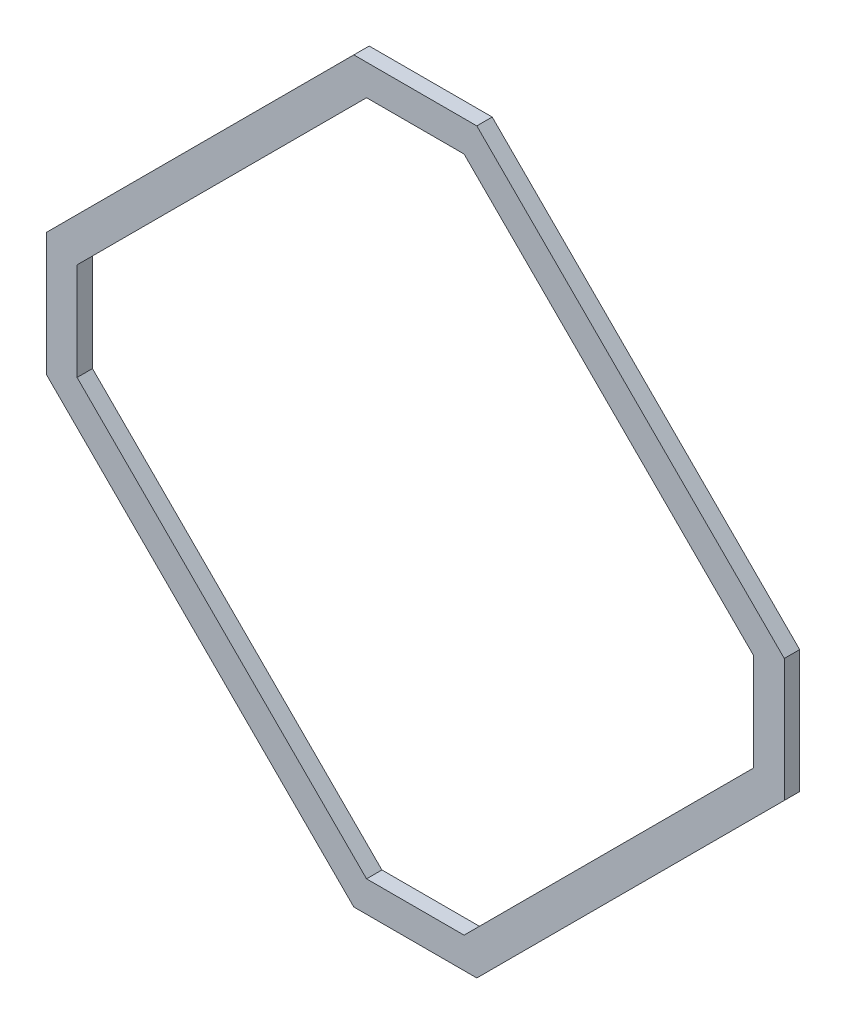
ISO-10303-21;
HEADER;
FILE_DESCRIPTION(('STEP AP214'),'2;1');
FILE_NAME('part.step','',(''),(''),'','','');
FILE_SCHEMA(('AUTOMOTIVE_DESIGN { 1 0 10303 214 1 1 1 1 }'));
ENDSEC;
DATA;
#1=APPLICATION_CONTEXT('core data for automotive mechanical design processes');
#2=APPLICATION_PROTOCOL_DEFINITION('international standard','automotive_design',2000,#1);
#3=PRODUCT_CONTEXT('',#1,'mechanical');
#4=PRODUCT('Part','Part','',(#3));
#5=PRODUCT_RELATED_PRODUCT_CATEGORY('part','',(#4));
#6=PRODUCT_DEFINITION_FORMATION('','',#4);
#7=PRODUCT_DEFINITION_CONTEXT('part definition',#1,'design');
#8=PRODUCT_DEFINITION('design','',#6,#7);
#9=PRODUCT_DEFINITION_SHAPE('','',#8);
#10=(LENGTH_UNIT() NAMED_UNIT(*) SI_UNIT(.MILLI.,.METRE.));
#11=(NAMED_UNIT(*) PLANE_ANGLE_UNIT() SI_UNIT($,.RADIAN.));
#12=(NAMED_UNIT(*) SI_UNIT($,.STERADIAN.) SOLID_ANGLE_UNIT());
#13=UNCERTAINTY_MEASURE_WITH_UNIT(LENGTH_MEASURE(1.E-05),#10,'distance_accuracy_value','');
#14=(GEOMETRIC_REPRESENTATION_CONTEXT(3) GLOBAL_UNCERTAINTY_ASSIGNED_CONTEXT((#13)) GLOBAL_UNIT_ASSIGNED_CONTEXT((#10,
#11,#12)) REPRESENTATION_CONTEXT('',''));
#15=CARTESIAN_POINT('',(0.,0.,0.));
#16=DIRECTION('',(0.,0.,1.));
#17=DIRECTION('',(1.,0.,0.));
#18=AXIS2_PLACEMENT_3D('',#15,#16,#17);
#19=CARTESIAN_POINT('',(0.,0.,3.175));
#20=DIRECTION('',(0.,0.,1.));
#21=DIRECTION('',(1.,0.,0.));
#22=AXIS2_PLACEMENT_3D('',#19,#20,#21);
#23=PLANE('',#22);
#24=DIRECTION('',(0.,1.,0.));
#25=VECTOR('',#24,1.);
#26=CARTESIAN_POINT('',(63.5000000000004,-103.9114,3.175));
#27=LINE('',#26,#25);
#28=CARTESIAN_POINT('',(63.5000000000004,-103.9114,3.175));
#29=VERTEX_POINT('',#28);
#30=CARTESIAN_POINT('',(63.5000000000005,-78.5113999999998,3.175));
#31=VERTEX_POINT('',#30);
#32=EDGE_CURVE('E259',#29,#31,#27,.T.);
#33=ORIENTED_EDGE('',*,*,#32,.T.);
#34=DIRECTION('',(-0.707106781186549,0.707106781186546,0.));
#35=VECTOR('',#34,1.);
#36=CARTESIAN_POINT('',(63.5000000000005,-78.5113999999998,3.175));
#37=LINE('',#36,#35);
#38=CARTESIAN_POINT('',(3.40005801291454E-13,-15.0113999999998,3.175));
#39=VERTEX_POINT('',#38);
#40=EDGE_CURVE('E262',#31,#39,#37,.T.);
#41=ORIENTED_EDGE('',*,*,#40,.T.);
#42=DIRECTION('',(-1.,0.,0.));
#43=VECTOR('',#42,1.);
#44=CARTESIAN_POINT('',(3.40005801291454E-13,-15.0113999999998,3.175));
#45=LINE('',#44,#43);
#46=CARTESIAN_POINT('',(-25.3999999999997,-15.0113999999997,3.175));
#47=VERTEX_POINT('',#46);
#48=EDGE_CURVE('E265',#39,#47,#45,.T.);
#49=ORIENTED_EDGE('',*,*,#48,.T.);
#50=DIRECTION('',(-0.707106781186546,-0.707106781186549,0.));
#51=VECTOR('',#50,1.);
#52=CARTESIAN_POINT('',(-25.3999999999997,-15.0113999999997,3.175));
#53=LINE('',#52,#51);
#54=CARTESIAN_POINT('',(-88.8999999999996,-78.5113999999999,3.175));
#55=VERTEX_POINT('',#54);
#56=EDGE_CURVE('E267',#47,#55,#53,.T.);
#57=ORIENTED_EDGE('',*,*,#56,.T.);
#58=DIRECTION('',(0.,-1.,0.));
#59=VECTOR('',#58,1.);
#60=CARTESIAN_POINT('',(-88.8999999999996,-78.5113999999999,3.175));
#61=LINE('',#60,#59);
#62=CARTESIAN_POINT('',(-88.8999999999997,-103.9114,3.175));
#63=VERTEX_POINT('',#62);
#64=EDGE_CURVE('E269',#55,#63,#61,.T.);
#65=ORIENTED_EDGE('',*,*,#64,.T.);
#66=DIRECTION('',(0.707106781186549,-0.707106781186546,0.));
#67=VECTOR('',#66,1.);
#68=CARTESIAN_POINT('',(-88.8999999999997,-103.9114,3.175));
#69=LINE('',#68,#67);
#70=CARTESIAN_POINT('',(-25.3999999999995,-167.4114,3.175));
#71=VERTEX_POINT('',#70);
#72=EDGE_CURVE('E271',#63,#71,#69,.T.);
#73=ORIENTED_EDGE('',*,*,#72,.T.);
#74=DIRECTION('',(1.,0.,0.));
#75=VECTOR('',#74,1.);
#76=CARTESIAN_POINT('',(-25.3999999999995,-167.4114,3.175));
#77=LINE('',#76,#75);
#78=CARTESIAN_POINT('',(4.9960036108132E-13,-167.4114,3.175));
#79=VERTEX_POINT('',#78);
#80=EDGE_CURVE('E273',#71,#79,#77,.T.);
#81=ORIENTED_EDGE('',*,*,#80,.T.);
#82=DIRECTION('',(0.707106781186546,0.707106781186549,0.));
#83=VECTOR('',#82,1.);
#84=CARTESIAN_POINT('',(4.9960036108132E-13,-167.4114,3.175));
#85=LINE('',#84,#83);
#86=EDGE_CURVE('E275',#79,#29,#85,.T.);
#87=ORIENTED_EDGE('',*,*,#86,.T.);
#88=EDGE_LOOP('',(#33,#41,#49,#57,#65,#73,#81,#87));
#89=FACE_BOUND('',#88,.T.);
#90=DIRECTION('',(-0.707106781186549,0.707106781186546,0.));
#91=VECTOR('',#90,1.);
#92=CARTESIAN_POINT('',(57.1500000000005,-81.1416561210689,3.175));
#93=LINE('',#92,#91);
#94=CARTESIAN_POINT('',(57.1500000000005,-81.1416561210689,3.175));
#95=VERTEX_POINT('',#94);
#96=CARTESIAN_POINT('',(-2.63025612106882,-21.3613999999998,3.175));
#97=VERTEX_POINT('',#96);
#98=EDGE_CURVE('E202',#95,#97,#93,.T.);
#99=ORIENTED_EDGE('',*,*,#98,.F.);
#100=DIRECTION('',(0.,1.,0.));
#101=VECTOR('',#100,1.);
#102=CARTESIAN_POINT('',(57.1500000000005,-101.28114387893,3.175));
#103=LINE('',#102,#101);
#104=CARTESIAN_POINT('',(57.1500000000005,-101.28114387893,3.175));
#105=VERTEX_POINT('',#104);
#106=EDGE_CURVE('E194',#105,#95,#103,.T.);
#107=ORIENTED_EDGE('',*,*,#106,.F.);
#108=DIRECTION('',(0.707106781186546,0.707106781186549,0.));
#109=VECTOR('',#108,1.);
#110=CARTESIAN_POINT('',(-2.63025612106868,-161.0614,3.175));
#111=LINE('',#110,#109);
#112=CARTESIAN_POINT('',(-2.63025612106867,-161.0614,3.175));
#113=VERTEX_POINT('',#112);
#114=EDGE_CURVE('E227',#113,#105,#111,.T.);
#115=ORIENTED_EDGE('',*,*,#114,.F.);
#116=DIRECTION('',(1.,0.,0.));
#117=VECTOR('',#116,1.);
#118=CARTESIAN_POINT('',(-22.7697438789303,-161.0614,3.175));
#119=LINE('',#118,#117);
#120=CARTESIAN_POINT('',(-22.7697438789303,-161.0614,3.175));
#121=VERTEX_POINT('',#120);
#122=EDGE_CURVE('E225',#121,#113,#119,.T.);
#123=ORIENTED_EDGE('',*,*,#122,.F.);
#124=DIRECTION('',(0.707106781186549,-0.707106781186546,0.));
#125=VECTOR('',#124,1.);
#126=CARTESIAN_POINT('',(-82.5499999999997,-101.281143878931,3.175));
#127=LINE('',#126,#125);
#128=CARTESIAN_POINT('',(-82.5499999999997,-101.281143878931,3.175));
#129=VERTEX_POINT('',#128);
#130=EDGE_CURVE('E223',#129,#121,#127,.T.);
#131=ORIENTED_EDGE('',*,*,#130,.F.);
#132=DIRECTION('',(0.,-1.,0.));
#133=VECTOR('',#132,1.);
#134=CARTESIAN_POINT('',(-82.5499999999997,-81.1416561210691,3.175));
#135=LINE('',#134,#133);
#136=CARTESIAN_POINT('',(-82.5499999999997,-81.1416561210691,3.175));
#137=VERTEX_POINT('',#136);
#138=EDGE_CURVE('E221',#137,#129,#135,.T.);
#139=ORIENTED_EDGE('',*,*,#138,.F.);
#140=DIRECTION('',(-0.707106781186546,-0.707106781186549,0.));
#141=VECTOR('',#140,1.);
#142=CARTESIAN_POINT('',(-22.7697438789306,-21.3613999999998,3.175));
#143=LINE('',#142,#141);
#144=CARTESIAN_POINT('',(-22.7697438789306,-21.3613999999998,3.175));
#145=VERTEX_POINT('',#144);
#146=EDGE_CURVE('E217',#145,#137,#143,.T.);
#147=ORIENTED_EDGE('',*,*,#146,.F.);
#148=DIRECTION('',(-1.,0.,0.));
#149=VECTOR('',#148,1.);
#150=CARTESIAN_POINT('',(-2.63025612106882,-21.3613999999998,3.175));
#151=LINE('',#150,#149);
#152=EDGE_CURVE('E215',#97,#145,#151,.T.);
#153=ORIENTED_EDGE('',*,*,#152,.F.);
#154=EDGE_LOOP('',(#99,#107,#115,#123,#131,#139,#147,#153));
#155=FACE_BOUND('',#154,.T.);
#156=ADVANCED_FACE('F81',(#89,#155),#23,.T.);
#157=CARTESIAN_POINT('',(0.,0.,0.));
#158=DIRECTION('',(0.,0.,1.));
#159=DIRECTION('',(1.,0.,0.));
#160=AXIS2_PLACEMENT_3D('',#157,#158,#159);
#161=PLANE('',#160);
#162=DIRECTION('',(0.,1.,0.));
#163=VECTOR('',#162,1.);
#164=CARTESIAN_POINT('',(63.5000000000004,-103.9114,0.));
#165=LINE('',#164,#163);
#166=CARTESIAN_POINT('',(63.5000000000004,-103.9114,0.));
#167=VERTEX_POINT('',#166);
#168=CARTESIAN_POINT('',(63.5000000000005,-78.5113999999998,0.));
#169=VERTEX_POINT('',#168);
#170=EDGE_CURVE('E210',#167,#169,#165,.T.);
#171=ORIENTED_EDGE('',*,*,#170,.F.);
#172=DIRECTION('',(0.707106781186546,0.707106781186549,0.));
#173=VECTOR('',#172,1.);
#174=CARTESIAN_POINT('',(4.9960036108132E-13,-167.4114,0.));
#175=LINE('',#174,#173);
#176=CARTESIAN_POINT('',(4.9960036108132E-13,-167.4114,0.));
#177=VERTEX_POINT('',#176);
#178=EDGE_CURVE('E263',#177,#167,#175,.T.);
#179=ORIENTED_EDGE('',*,*,#178,.F.);
#180=DIRECTION('',(1.,0.,0.));
#181=VECTOR('',#180,1.);
#182=CARTESIAN_POINT('',(-25.3999999999995,-167.4114,0.));
#183=LINE('',#182,#181);
#184=CARTESIAN_POINT('',(-25.3999999999995,-167.4114,0.));
#185=VERTEX_POINT('',#184);
#186=EDGE_CURVE('E290',#185,#177,#183,.T.);
#187=ORIENTED_EDGE('',*,*,#186,.F.);
#188=DIRECTION('',(0.707106781186549,-0.707106781186546,0.));
#189=VECTOR('',#188,1.);
#190=CARTESIAN_POINT('',(-88.8999999999997,-103.9114,0.));
#191=LINE('',#190,#189);
#192=CARTESIAN_POINT('',(-88.8999999999997,-103.9114,0.));
#193=VERTEX_POINT('',#192);
#194=EDGE_CURVE('E288',#193,#185,#191,.T.);
#195=ORIENTED_EDGE('',*,*,#194,.F.);
#196=DIRECTION('',(0.,-1.,0.));
#197=VECTOR('',#196,1.);
#198=CARTESIAN_POINT('',(-88.8999999999996,-78.5113999999999,0.));
#199=LINE('',#198,#197);
#200=CARTESIAN_POINT('',(-88.8999999999996,-78.5113999999999,0.));
#201=VERTEX_POINT('',#200);
#202=EDGE_CURVE('E286',#201,#193,#199,.T.);
#203=ORIENTED_EDGE('',*,*,#202,.F.);
#204=DIRECTION('',(-0.707106781186546,-0.707106781186549,0.));
#205=VECTOR('',#204,1.);
#206=CARTESIAN_POINT('',(-25.3999999999997,-15.0113999999997,0.));
#207=LINE('',#206,#205);
#208=CARTESIAN_POINT('',(-25.3999999999997,-15.0113999999997,0.));
#209=VERTEX_POINT('',#208);
#210=EDGE_CURVE('E284',#209,#201,#207,.T.);
#211=ORIENTED_EDGE('',*,*,#210,.F.);
#212=DIRECTION('',(-1.,0.,0.));
#213=VECTOR('',#212,1.);
#214=CARTESIAN_POINT('',(3.40005801291454E-13,-15.0113999999998,0.));
#215=LINE('',#214,#213);
#216=CARTESIAN_POINT('',(3.40005801291454E-13,-15.0113999999998,0.));
#217=VERTEX_POINT('',#216);
#218=EDGE_CURVE('E282',#217,#209,#215,.T.);
#219=ORIENTED_EDGE('',*,*,#218,.F.);
#220=DIRECTION('',(-0.707106781186549,0.707106781186546,0.));
#221=VECTOR('',#220,1.);
#222=CARTESIAN_POINT('',(63.5000000000005,-78.5113999999998,0.));
#223=LINE('',#222,#221);
#224=EDGE_CURVE('E280',#169,#217,#223,.T.);
#225=ORIENTED_EDGE('',*,*,#224,.F.);
#226=EDGE_LOOP('',(#171,#179,#187,#195,#203,#211,#219,#225));
#227=FACE_BOUND('',#226,.T.);
#228=DIRECTION('',(0.,1.,0.));
#229=VECTOR('',#228,1.);
#230=CARTESIAN_POINT('',(57.1500000000005,-101.28114387893,0.));
#231=LINE('',#230,#229);
#232=CARTESIAN_POINT('',(57.1500000000005,-101.28114387893,0.));
#233=VERTEX_POINT('',#232);
#234=CARTESIAN_POINT('',(57.1500000000005,-81.1416561210689,0.));
#235=VERTEX_POINT('',#234);
#236=EDGE_CURVE('E104',#233,#235,#231,.T.);
#237=ORIENTED_EDGE('',*,*,#236,.T.);
#238=DIRECTION('',(-0.707106781186549,0.707106781186546,0.));
#239=VECTOR('',#238,1.);
#240=CARTESIAN_POINT('',(57.1500000000005,-81.1416561210689,0.));
#241=LINE('',#240,#239);
#242=CARTESIAN_POINT('',(-2.63025612106882,-21.3613999999998,0.));
#243=VERTEX_POINT('',#242);
#244=EDGE_CURVE('E209',#235,#243,#241,.T.);
#245=ORIENTED_EDGE('',*,*,#244,.T.);
#246=DIRECTION('',(-1.,0.,0.));
#247=VECTOR('',#246,1.);
#248=CARTESIAN_POINT('',(-2.63025612106882,-21.3613999999998,0.));
#249=LINE('',#248,#247);
#250=CARTESIAN_POINT('',(-22.7697438789306,-21.3613999999998,0.));
#251=VERTEX_POINT('',#250);
#252=EDGE_CURVE('E231',#243,#251,#249,.T.);
#253=ORIENTED_EDGE('',*,*,#252,.T.);
#254=DIRECTION('',(-0.707106781186546,-0.707106781186549,0.));
#255=VECTOR('',#254,1.);
#256=CARTESIAN_POINT('',(-22.7697438789306,-21.3613999999998,0.));
#257=LINE('',#256,#255);
#258=CARTESIAN_POINT('',(-82.5499999999997,-81.1416561210691,0.));
#259=VERTEX_POINT('',#258);
#260=EDGE_CURVE('E234',#251,#259,#257,.T.);
#261=ORIENTED_EDGE('',*,*,#260,.T.);
#262=DIRECTION('',(0.,-1.,0.));
#263=VECTOR('',#262,1.);
#264=CARTESIAN_POINT('',(-82.5499999999997,-81.1416561210691,0.));
#265=LINE('',#264,#263);
#266=CARTESIAN_POINT('',(-82.5499999999997,-101.281143878931,0.));
#267=VERTEX_POINT('',#266);
#268=EDGE_CURVE('E237',#259,#267,#265,.T.);
#269=ORIENTED_EDGE('',*,*,#268,.T.);
#270=DIRECTION('',(0.707106781186549,-0.707106781186546,0.));
#271=VECTOR('',#270,1.);
#272=CARTESIAN_POINT('',(-82.5499999999997,-101.281143878931,0.));
#273=LINE('',#272,#271);
#274=CARTESIAN_POINT('',(-22.7697438789303,-161.0614,0.));
#275=VERTEX_POINT('',#274);
#276=EDGE_CURVE('E240',#267,#275,#273,.T.);
#277=ORIENTED_EDGE('',*,*,#276,.T.);
#278=DIRECTION('',(1.,0.,0.));
#279=VECTOR('',#278,1.);
#280=CARTESIAN_POINT('',(-22.7697438789303,-161.0614,0.));
#281=LINE('',#280,#279);
#282=CARTESIAN_POINT('',(-2.63025612106868,-161.0614,0.));
#283=VERTEX_POINT('',#282);
#284=EDGE_CURVE('E243',#275,#283,#281,.T.);
#285=ORIENTED_EDGE('',*,*,#284,.T.);
#286=DIRECTION('',(0.707106781186546,0.707106781186549,0.));
#287=VECTOR('',#286,1.);
#288=CARTESIAN_POINT('',(-2.63025612106868,-161.0614,0.));
#289=LINE('',#288,#287);
#290=EDGE_CURVE('E203',#283,#233,#289,.T.);
#291=ORIENTED_EDGE('',*,*,#290,.T.);
#292=EDGE_LOOP('',(#237,#245,#253,#261,#269,#277,#285,#291));
#293=FACE_BOUND('',#292,.T.);
#294=ADVANCED_FACE('F320',(#227,#293),#161,.F.);
#295=CARTESIAN_POINT('',(63.5000000000004,-103.9114,3.175));
#296=DIRECTION('',(-1.,0.,0.));
#297=DIRECTION('',(0.,-1.,0.));
#298=AXIS2_PLACEMENT_3D('',#295,#296,#297);
#299=PLANE('',#298);
#300=ORIENTED_EDGE('',*,*,#170,.T.);
#301=DIRECTION('',(0.,0.,-1.));
#302=VECTOR('',#301,1.);
#303=CARTESIAN_POINT('',(63.5000000000005,-78.5113999999998,3.175));
#304=LINE('',#303,#302);
#305=EDGE_CURVE('E12',#31,#169,#304,.T.);
#306=ORIENTED_EDGE('',*,*,#305,.F.);
#307=ORIENTED_EDGE('',*,*,#32,.F.);
#308=DIRECTION('',(0.,0.,-1.));
#309=VECTOR('',#308,1.);
#310=CARTESIAN_POINT('',(63.5000000000004,-103.9114,3.175));
#311=LINE('',#310,#309);
#312=EDGE_CURVE('E277',#29,#167,#311,.T.);
#313=ORIENTED_EDGE('',*,*,#312,.T.);
#314=EDGE_LOOP('',(#300,#306,#307,#313));
#315=FACE_BOUND('',#314,.T.);
#316=ADVANCED_FACE('F83',(#315),#299,.F.);
#317=CARTESIAN_POINT('',(63.5000000000005,-78.5113999999998,3.175));
#318=DIRECTION('',(-0.707106781186546,-0.707106781186548,0.));
#319=DIRECTION('',(0.707106781186549,-0.707106781186547,0.));
#320=AXIS2_PLACEMENT_3D('',#317,#318,#319);
#321=PLANE('',#320);
#322=ORIENTED_EDGE('',*,*,#224,.T.);
#323=DIRECTION('',(0.,0.,-1.));
#324=VECTOR('',#323,1.);
#325=CARTESIAN_POINT('',(3.40005801291454E-13,-15.0113999999998,3.175));
#326=LINE('',#325,#324);
#327=EDGE_CURVE('E89',#39,#217,#326,.T.);
#328=ORIENTED_EDGE('',*,*,#327,.F.);
#329=ORIENTED_EDGE('',*,*,#40,.F.);
#330=ORIENTED_EDGE('',*,*,#305,.T.);
#331=EDGE_LOOP('',(#322,#328,#329,#330));
#332=FACE_BOUND('',#331,.T.);
#333=ADVANCED_FACE('F337',(#332),#321,.F.);
#334=CARTESIAN_POINT('',(3.40005801291454E-13,-15.0113999999998,3.175));
#335=DIRECTION('',(0.,-1.,0.));
#336=DIRECTION('',(1.,0.,0.));
#337=AXIS2_PLACEMENT_3D('',#334,#335,#336);
#338=PLANE('',#337);
#339=ORIENTED_EDGE('',*,*,#218,.T.);
#340=DIRECTION('',(0.,0.,-1.));
#341=VECTOR('',#340,1.);
#342=CARTESIAN_POINT('',(-25.3999999999997,-15.0113999999997,3.175));
#343=LINE('',#342,#341);
#344=EDGE_CURVE('E307',#47,#209,#343,.T.);
#345=ORIENTED_EDGE('',*,*,#344,.F.);
#346=ORIENTED_EDGE('',*,*,#48,.F.);
#347=ORIENTED_EDGE('',*,*,#327,.T.);
#348=EDGE_LOOP('',(#339,#345,#346,#347));
#349=FACE_BOUND('',#348,.T.);
#350=ADVANCED_FACE('F314',(#349),#338,.F.);
#351=CARTESIAN_POINT('',(-25.3999999999997,-15.0113999999997,3.175));
#352=DIRECTION('',(0.707106781186549,-0.707106781186546,0.));
#353=DIRECTION('',(0.707106781186546,0.707106781186549,0.));
#354=AXIS2_PLACEMENT_3D('',#351,#352,#353);
#355=PLANE('',#354);
#356=ORIENTED_EDGE('',*,*,#210,.T.);
#357=DIRECTION('',(0.,0.,-1.));
#358=VECTOR('',#357,1.);
#359=CARTESIAN_POINT('',(-88.8999999999996,-78.5113999999999,3.175));
#360=LINE('',#359,#358);
#361=EDGE_CURVE('E304',#55,#201,#360,.T.);
#362=ORIENTED_EDGE('',*,*,#361,.F.);
#363=ORIENTED_EDGE('',*,*,#56,.F.);
#364=ORIENTED_EDGE('',*,*,#344,.T.);
#365=EDGE_LOOP('',(#356,#362,#363,#364));
#366=FACE_BOUND('',#365,.T.);
#367=ADVANCED_FACE('F326',(#366),#355,.F.);
#368=CARTESIAN_POINT('',(-88.8999999999996,-78.5113999999999,3.175));
#369=DIRECTION('',(1.,0.,0.));
#370=DIRECTION('',(0.,1.,0.));
#371=AXIS2_PLACEMENT_3D('',#368,#369,#370);
#372=PLANE('',#371);
#373=ORIENTED_EDGE('',*,*,#202,.T.);
#374=DIRECTION('',(0.,0.,-1.));
#375=VECTOR('',#374,1.);
#376=CARTESIAN_POINT('',(-88.8999999999997,-103.9114,3.175));
#377=LINE('',#376,#375);
#378=EDGE_CURVE('E301',#63,#193,#377,.T.);
#379=ORIENTED_EDGE('',*,*,#378,.F.);
#380=ORIENTED_EDGE('',*,*,#64,.F.);
#381=ORIENTED_EDGE('',*,*,#361,.T.);
#382=EDGE_LOOP('',(#373,#379,#380,#381));
#383=FACE_BOUND('',#382,.T.);
#384=ADVANCED_FACE('F330',(#383),#372,.F.);
#385=CARTESIAN_POINT('',(-88.8999999999997,-103.9114,3.175));
#386=DIRECTION('',(0.707106781186546,0.707106781186549,0.));
#387=DIRECTION('',(-0.707106781186549,0.707106781186546,0.));
#388=AXIS2_PLACEMENT_3D('',#385,#386,#387);
#389=PLANE('',#388);
#390=ORIENTED_EDGE('',*,*,#194,.T.);
#391=DIRECTION('',(0.,0.,-1.));
#392=VECTOR('',#391,1.);
#393=CARTESIAN_POINT('',(-25.3999999999995,-167.4114,3.175));
#394=LINE('',#393,#392);
#395=EDGE_CURVE('E298',#71,#185,#394,.T.);
#396=ORIENTED_EDGE('',*,*,#395,.F.);
#397=ORIENTED_EDGE('',*,*,#72,.F.);
#398=ORIENTED_EDGE('',*,*,#378,.T.);
#399=EDGE_LOOP('',(#390,#396,#397,#398));
#400=FACE_BOUND('',#399,.T.);
#401=ADVANCED_FACE('F350',(#400),#389,.F.);
#402=CARTESIAN_POINT('',(-25.3999999999995,-167.4114,3.175));
#403=DIRECTION('',(0.,1.,0.));
#404=DIRECTION('',(-1.,0.,0.));
#405=AXIS2_PLACEMENT_3D('',#402,#403,#404);
#406=PLANE('',#405);
#407=ORIENTED_EDGE('',*,*,#186,.T.);
#408=DIRECTION('',(0.,0.,-1.));
#409=VECTOR('',#408,1.);
#410=CARTESIAN_POINT('',(4.9960036108132E-13,-167.4114,3.175));
#411=LINE('',#410,#409);
#412=EDGE_CURVE('E295',#79,#177,#411,.T.);
#413=ORIENTED_EDGE('',*,*,#412,.F.);
#414=ORIENTED_EDGE('',*,*,#80,.F.);
#415=ORIENTED_EDGE('',*,*,#395,.T.);
#416=EDGE_LOOP('',(#407,#413,#414,#415));
#417=FACE_BOUND('',#416,.T.);
#418=ADVANCED_FACE('F348',(#417),#406,.F.);
#419=CARTESIAN_POINT('',(4.9960036108132E-13,-167.4114,3.175));
#420=DIRECTION('',(-0.707106781186549,0.707106781186546,0.));
#421=DIRECTION('',(-0.707106781186546,-0.707106781186549,0.));
#422=AXIS2_PLACEMENT_3D('',#419,#420,#421);
#423=PLANE('',#422);
#424=ORIENTED_EDGE('',*,*,#178,.T.);
#425=ORIENTED_EDGE('',*,*,#312,.F.);
#426=ORIENTED_EDGE('',*,*,#86,.F.);
#427=ORIENTED_EDGE('',*,*,#412,.T.);
#428=EDGE_LOOP('',(#424,#425,#426,#427));
#429=FACE_BOUND('',#428,.T.);
#430=ADVANCED_FACE('F343',(#429),#423,.F.);
#431=CARTESIAN_POINT('',(57.1500000000005,-101.28114387893,3.175));
#432=DIRECTION('',(-1.,0.,0.));
#433=DIRECTION('',(0.,0.,1.));
#434=AXIS2_PLACEMENT_3D('',#431,#432,#433);
#435=PLANE('',#434);
#436=ORIENTED_EDGE('',*,*,#236,.F.);
#437=DIRECTION('',(0.,0.,-1.));
#438=VECTOR('',#437,1.);
#439=CARTESIAN_POINT('',(57.1500000000005,-101.28114387893,3.175));
#440=LINE('',#439,#438);
#441=EDGE_CURVE('E198',#105,#233,#440,.T.);
#442=ORIENTED_EDGE('',*,*,#441,.F.);
#443=ORIENTED_EDGE('',*,*,#106,.T.);
#444=DIRECTION('',(0.,0.,-1.));
#445=VECTOR('',#444,1.);
#446=CARTESIAN_POINT('',(57.1500000000005,-81.1416561210689,3.175));
#447=LINE('',#446,#445);
#448=EDGE_CURVE('E197',#95,#235,#447,.T.);
#449=ORIENTED_EDGE('',*,*,#448,.T.);
#450=EDGE_LOOP('',(#436,#442,#443,#449));
#451=FACE_BOUND('',#450,.T.);
#452=ADVANCED_FACE('F196',(#451),#435,.T.);
#453=CARTESIAN_POINT('',(57.1500000000005,-81.1416561210689,3.175));
#454=DIRECTION('',(-0.707106781186546,-0.707106781186549,0.));
#455=DIRECTION('',(0.707106781186549,-0.707106781186546,0.));
#456=AXIS2_PLACEMENT_3D('',#453,#454,#455);
#457=PLANE('',#456);
#458=ORIENTED_EDGE('',*,*,#244,.F.);
#459=ORIENTED_EDGE('',*,*,#448,.F.);
#460=ORIENTED_EDGE('',*,*,#98,.T.);
#461=DIRECTION('',(0.,0.,-1.));
#462=VECTOR('',#461,1.);
#463=CARTESIAN_POINT('',(-2.63025612106882,-21.3613999999998,3.175));
#464=LINE('',#463,#462);
#465=EDGE_CURVE('E211',#97,#243,#464,.T.);
#466=ORIENTED_EDGE('',*,*,#465,.T.);
#467=EDGE_LOOP('',(#458,#459,#460,#466));
#468=FACE_BOUND('',#467,.T.);
#469=ADVANCED_FACE('F206',(#468),#457,.T.);
#470=CARTESIAN_POINT('',(-2.63025612106882,-21.3613999999998,3.175));
#471=DIRECTION('',(0.,-1.,0.));
#472=DIRECTION('',(0.,0.,-1.));
#473=AXIS2_PLACEMENT_3D('',#470,#471,#472);
#474=PLANE('',#473);
#475=ORIENTED_EDGE('',*,*,#252,.F.);
#476=ORIENTED_EDGE('',*,*,#465,.F.);
#477=ORIENTED_EDGE('',*,*,#152,.T.);
#478=DIRECTION('',(0.,0.,-1.));
#479=VECTOR('',#478,1.);
#480=CARTESIAN_POINT('',(-22.7697438789306,-21.3613999999998,3.175));
#481=LINE('',#480,#479);
#482=EDGE_CURVE('E256',#145,#251,#481,.T.);
#483=ORIENTED_EDGE('',*,*,#482,.T.);
#484=EDGE_LOOP('',(#475,#476,#477,#483));
#485=FACE_BOUND('',#484,.T.);
#486=ADVANCED_FACE('F375',(#485),#474,.T.);
#487=CARTESIAN_POINT('',(-22.7697438789306,-21.3613999999998,3.175));
#488=DIRECTION('',(0.707106781186549,-0.707106781186546,0.));
#489=DIRECTION('',(0.707106781186546,0.707106781186549,0.));
#490=AXIS2_PLACEMENT_3D('',#487,#488,#489);
#491=PLANE('',#490);
#492=ORIENTED_EDGE('',*,*,#260,.F.);
#493=ORIENTED_EDGE('',*,*,#482,.F.);
#494=ORIENTED_EDGE('',*,*,#146,.T.);
#495=DIRECTION('',(0.,0.,-1.));
#496=VECTOR('',#495,1.);
#497=CARTESIAN_POINT('',(-82.5499999999997,-81.1416561210691,3.175));
#498=LINE('',#497,#496);
#499=EDGE_CURVE('E254',#137,#259,#498,.T.);
#500=ORIENTED_EDGE('',*,*,#499,.T.);
#501=EDGE_LOOP('',(#492,#493,#494,#500));
#502=FACE_BOUND('',#501,.T.);
#503=ADVANCED_FACE('F379',(#502),#491,.T.);
#504=CARTESIAN_POINT('',(-82.5499999999997,-81.1416561210691,3.175));
#505=DIRECTION('',(1.,0.,0.));
#506=DIRECTION('',(0.,0.,-1.));
#507=AXIS2_PLACEMENT_3D('',#504,#505,#506);
#508=PLANE('',#507);
#509=ORIENTED_EDGE('',*,*,#268,.F.);
#510=ORIENTED_EDGE('',*,*,#499,.F.);
#511=ORIENTED_EDGE('',*,*,#138,.T.);
#512=DIRECTION('',(0.,0.,-1.));
#513=VECTOR('',#512,1.);
#514=CARTESIAN_POINT('',(-82.5499999999997,-101.281143878931,3.175));
#515=LINE('',#514,#513);
#516=EDGE_CURVE('E252',#129,#267,#515,.T.);
#517=ORIENTED_EDGE('',*,*,#516,.T.);
#518=EDGE_LOOP('',(#509,#510,#511,#517));
#519=FACE_BOUND('',#518,.T.);
#520=ADVANCED_FACE('F385',(#519),#508,.T.);
#521=CARTESIAN_POINT('',(-82.5499999999997,-101.281143878931,3.175));
#522=DIRECTION('',(0.707106781186546,0.707106781186549,0.));
#523=DIRECTION('',(-0.707106781186549,0.707106781186546,0.));
#524=AXIS2_PLACEMENT_3D('',#521,#522,#523);
#525=PLANE('',#524);
#526=ORIENTED_EDGE('',*,*,#276,.F.);
#527=ORIENTED_EDGE('',*,*,#516,.F.);
#528=ORIENTED_EDGE('',*,*,#130,.T.);
#529=DIRECTION('',(0.,0.,-1.));
#530=VECTOR('',#529,1.);
#531=CARTESIAN_POINT('',(-22.7697438789303,-161.0614,3.175));
#532=LINE('',#531,#530);
#533=EDGE_CURVE('E250',#121,#275,#532,.T.);
#534=ORIENTED_EDGE('',*,*,#533,.T.);
#535=EDGE_LOOP('',(#526,#527,#528,#534));
#536=FACE_BOUND('',#535,.T.);
#537=ADVANCED_FACE('F389',(#536),#525,.T.);
#538=CARTESIAN_POINT('',(-22.7697438789303,-161.0614,3.175));
#539=DIRECTION('',(0.,1.,0.));
#540=DIRECTION('',(0.,0.,1.));
#541=AXIS2_PLACEMENT_3D('',#538,#539,#540);
#542=PLANE('',#541);
#543=ORIENTED_EDGE('',*,*,#284,.F.);
#544=ORIENTED_EDGE('',*,*,#533,.F.);
#545=ORIENTED_EDGE('',*,*,#122,.T.);
#546=DIRECTION('',(0.,0.,-1.));
#547=VECTOR('',#546,1.);
#548=CARTESIAN_POINT('',(-2.63025612106868,-161.0614,3.175));
#549=LINE('',#548,#547);
#550=EDGE_CURVE('E96',#113,#283,#549,.T.);
#551=ORIENTED_EDGE('',*,*,#550,.T.);
#552=EDGE_LOOP('',(#543,#544,#545,#551));
#553=FACE_BOUND('',#552,.T.);
#554=ADVANCED_FACE('F393',(#553),#542,.T.);
#555=CARTESIAN_POINT('',(-2.63025612106868,-161.0614,3.175));
#556=DIRECTION('',(-0.707106781186549,0.707106781186546,0.));
#557=DIRECTION('',(-0.707106781186546,-0.707106781186549,0.));
#558=AXIS2_PLACEMENT_3D('',#555,#556,#557);
#559=PLANE('',#558);
#560=ORIENTED_EDGE('',*,*,#290,.F.);
#561=ORIENTED_EDGE('',*,*,#550,.F.);
#562=ORIENTED_EDGE('',*,*,#114,.T.);
#563=ORIENTED_EDGE('',*,*,#441,.T.);
#564=EDGE_LOOP('',(#560,#561,#562,#563));
#565=FACE_BOUND('',#564,.T.);
#566=ADVANCED_FACE('F397',(#565),#559,.T.);
#567=CLOSED_SHELL('',(#156,#294,#316,#333,#350,#367,#384,#401,#418,#430,#452,#469,#486,#503,
#520,#537,#554,#566));
#568=MANIFOLD_SOLID_BREP('B2',#567);
#569=ADVANCED_BREP_SHAPE_REPRESENTATION('',(#18,#568),#14);
#570=SHAPE_DEFINITION_REPRESENTATION(#9,#569);
ENDSEC;
END-ISO-10303-21;
